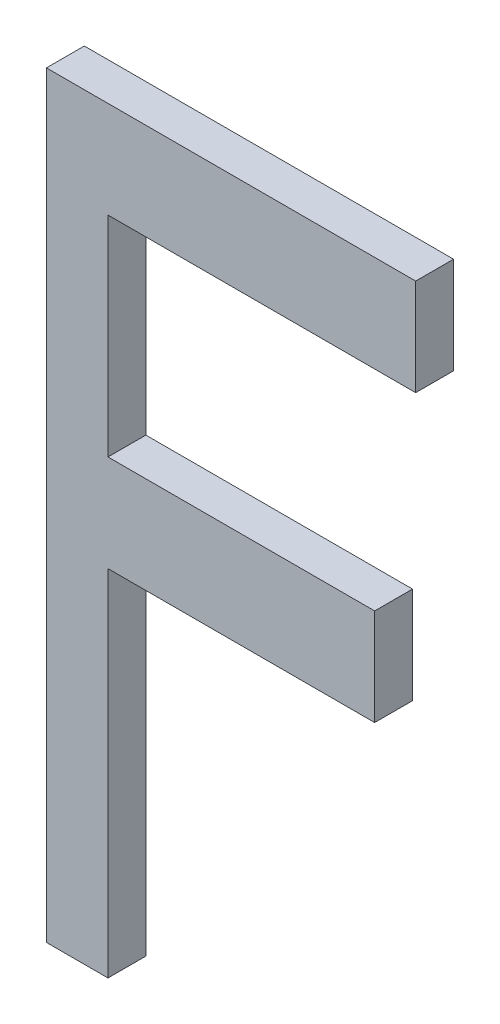
ISO-10303-21;
HEADER;
FILE_DESCRIPTION(('STEP AP214'),'2;1');
FILE_NAME('part.step','',(''),(''),'','','');
FILE_SCHEMA(('AUTOMOTIVE_DESIGN { 1 0 10303 214 1 1 1 1 }'));
ENDSEC;
DATA;
#1=APPLICATION_CONTEXT('core data for automotive mechanical design processes');
#2=APPLICATION_PROTOCOL_DEFINITION('international standard','automotive_design',2000,#1);
#3=PRODUCT_CONTEXT('',#1,'mechanical');
#4=PRODUCT('Part','Part','',(#3));
#5=PRODUCT_RELATED_PRODUCT_CATEGORY('part','',(#4));
#6=PRODUCT_DEFINITION_FORMATION('','',#4);
#7=PRODUCT_DEFINITION_CONTEXT('part definition',#1,'design');
#8=PRODUCT_DEFINITION('design','',#6,#7);
#9=PRODUCT_DEFINITION_SHAPE('','',#8);
#10=(LENGTH_UNIT() NAMED_UNIT(*) SI_UNIT(.MILLI.,.METRE.));
#11=(NAMED_UNIT(*) PLANE_ANGLE_UNIT() SI_UNIT($,.RADIAN.));
#12=(NAMED_UNIT(*) SI_UNIT($,.STERADIAN.) SOLID_ANGLE_UNIT());
#13=UNCERTAINTY_MEASURE_WITH_UNIT(LENGTH_MEASURE(1.E-05),#10,'distance_accuracy_value','');
#14=(GEOMETRIC_REPRESENTATION_CONTEXT(3) GLOBAL_UNCERTAINTY_ASSIGNED_CONTEXT((#13)) GLOBAL_UNIT_ASSIGNED_CONTEXT((#10,
#11,#12)) REPRESENTATION_CONTEXT('',''));
#15=CARTESIAN_POINT('',(0.,0.,0.));
#16=DIRECTION('',(0.,0.,1.));
#17=DIRECTION('',(1.,0.,0.));
#18=AXIS2_PLACEMENT_3D('',#15,#16,#17);
#19=CARTESIAN_POINT('',(128.914831113507,28.2906710184783,5.9));
#20=DIRECTION('',(0.,0.,1.));
#21=DIRECTION('',(1.,0.,0.));
#22=AXIS2_PLACEMENT_3D('',#19,#20,#21);
#23=PLANE('',#22);
#24=DIRECTION('',(1.,0.,0.));
#25=VECTOR('',#24,1.);
#26=CARTESIAN_POINT('',(128.914831113507,30.2906710184783,5.9));
#27=LINE('',#26,#25);
#28=CARTESIAN_POINT('',(129.889831113507,30.2906710184783,5.9));
#29=VERTEX_POINT('',#28);
#30=CARTESIAN_POINT('',(128.914831113507,30.2906710184783,5.9));
#31=VERTEX_POINT('',#30);
#32=EDGE_CURVE('E126',#29,#31,#27,.F.);
#33=ORIENTED_EDGE('',*,*,#32,.F.);
#34=DIRECTION('',(0.,1.,0.));
#35=VECTOR('',#34,1.);
#36=CARTESIAN_POINT('',(129.889831113507,28.2906710184783,5.9));
#37=LINE('',#36,#35);
#38=CARTESIAN_POINT('',(129.889831113507,30.0353518999783,5.9));
#39=VERTEX_POINT('',#38);
#40=EDGE_CURVE('E124',#39,#29,#37,.T.);
#41=ORIENTED_EDGE('',*,*,#40,.F.);
#42=DIRECTION('',(1.,0.,0.));
#43=VECTOR('',#42,1.);
#44=CARTESIAN_POINT('',(128.914831113507,30.0353518999783,5.9));
#45=LINE('',#44,#43);
#46=CARTESIAN_POINT('',(129.077331113507,30.0353518999783,5.9));
#47=VERTEX_POINT('',#46);
#48=EDGE_CURVE('E122',#47,#39,#45,.T.);
#49=ORIENTED_EDGE('',*,*,#48,.F.);
#50=DIRECTION('',(0.,1.,0.));
#51=VECTOR('',#50,1.);
#52=CARTESIAN_POINT('',(129.077331113508,28.2906710184783,5.9));
#53=LINE('',#52,#51);
#54=CARTESIAN_POINT('',(129.077331113508,29.4821603573583,5.9));
#55=VERTEX_POINT('',#54);
#56=EDGE_CURVE('E120',#55,#47,#53,.T.);
#57=ORIENTED_EDGE('',*,*,#56,.F.);
#58=DIRECTION('',(1.,0.,0.));
#59=VECTOR('',#58,1.);
#60=CARTESIAN_POINT('',(128.914831113507,29.4821603573583,5.9));
#61=LINE('',#60,#59);
#62=CARTESIAN_POINT('',(129.781497806007,29.4821603573583,5.9));
#63=VERTEX_POINT('',#62);
#64=EDGE_CURVE('E118',#63,#55,#61,.F.);
#65=ORIENTED_EDGE('',*,*,#64,.F.);
#66=DIRECTION('',(0.,1.,0.));
#67=VECTOR('',#66,1.);
#68=CARTESIAN_POINT('',(129.781497806007,28.2906710184783,5.9));
#69=LINE('',#68,#67);
#70=CARTESIAN_POINT('',(129.781497806007,29.2268412388583,5.9));
#71=VERTEX_POINT('',#70);
#72=EDGE_CURVE('E114',#71,#63,#69,.T.);
#73=ORIENTED_EDGE('',*,*,#72,.F.);
#74=DIRECTION('',(1.,0.,0.));
#75=VECTOR('',#74,1.);
#76=CARTESIAN_POINT('',(128.914831113507,29.2268412388583,5.9));
#77=LINE('',#76,#75);
#78=CARTESIAN_POINT('',(129.077331113507,29.2268412388583,5.9));
#79=VERTEX_POINT('',#78);
#80=EDGE_CURVE('E113',#79,#71,#77,.T.);
#81=ORIENTED_EDGE('',*,*,#80,.F.);
#82=DIRECTION('',(0.,1.,0.));
#83=VECTOR('',#82,1.);
#84=CARTESIAN_POINT('',(129.077331113508,28.2906710184783,5.9));
#85=LINE('',#84,#83);
#86=CARTESIAN_POINT('',(129.077331113508,28.2906710184783,5.9));
#87=VERTEX_POINT('',#86);
#88=EDGE_CURVE('E91',#87,#79,#85,.T.);
#89=ORIENTED_EDGE('',*,*,#88,.F.);
#90=DIRECTION('',(1.,0.,0.));
#91=VECTOR('',#90,1.);
#92=CARTESIAN_POINT('',(128.914831113507,28.2906710184783,5.9));
#93=LINE('',#92,#91);
#94=CARTESIAN_POINT('',(128.914831113507,28.2906710184783,5.9));
#95=VERTEX_POINT('',#94);
#96=EDGE_CURVE('E20',#95,#87,#93,.T.);
#97=ORIENTED_EDGE('',*,*,#96,.F.);
#98=DIRECTION('',(0.,1.,0.));
#99=VECTOR('',#98,1.);
#100=CARTESIAN_POINT('',(128.914831113507,30.2906710184783,5.9));
#101=LINE('',#100,#99);
#102=EDGE_CURVE('E128',#95,#31,#101,.T.);
#103=ORIENTED_EDGE('',*,*,#102,.T.);
#104=EDGE_LOOP('',(#33,#41,#49,#57,#65,#73,#81,#89,#97,#103));
#105=FACE_BOUND('',#104,.T.);
#106=ADVANCED_FACE('F17',(#105),#23,.F.);
#107=CARTESIAN_POINT('',(128.914831113507,30.2906710184783,6.));
#108=DIRECTION('',(1.,0.,0.));
#109=DIRECTION('',(0.,0.,-1.));
#110=AXIS2_PLACEMENT_3D('',#107,#108,#109);
#111=PLANE('',#110);
#112=DIRECTION('',(0.,0.,1.));
#113=VECTOR('',#112,1.);
#114=CARTESIAN_POINT('',(128.914831113507,28.2906710184783,6.));
#115=LINE('',#114,#113);
#116=CARTESIAN_POINT('',(128.914831113507,28.2906710184783,6.));
#117=VERTEX_POINT('',#116);
#118=EDGE_CURVE('E100',#95,#117,#115,.T.);
#119=ORIENTED_EDGE('',*,*,#118,.T.);
#120=DIRECTION('',(0.,1.,0.));
#121=VECTOR('',#120,1.);
#122=CARTESIAN_POINT('',(128.914831113507,28.2906710184783,6.));
#123=LINE('',#122,#121);
#124=CARTESIAN_POINT('',(128.914831113507,30.2906710184783,6.));
#125=VERTEX_POINT('',#124);
#126=EDGE_CURVE('E146',#125,#117,#123,.F.);
#127=ORIENTED_EDGE('',*,*,#126,.F.);
#128=DIRECTION('',(0.,0.,-1.));
#129=VECTOR('',#128,1.);
#130=CARTESIAN_POINT('',(128.914831113507,30.2906710184783,6.));
#131=LINE('',#130,#129);
#132=EDGE_CURVE('E143',#125,#31,#131,.T.);
#133=ORIENTED_EDGE('',*,*,#132,.T.);
#134=ORIENTED_EDGE('',*,*,#102,.F.);
#135=EDGE_LOOP('',(#119,#127,#133,#134));
#136=FACE_BOUND('',#135,.T.);
#137=ADVANCED_FACE('F181',(#136),#111,.F.);
#138=CARTESIAN_POINT('',(128.914831113507,28.2906710184783,6.));
#139=DIRECTION('',(0.,1.,0.));
#140=DIRECTION('',(0.,0.,1.));
#141=AXIS2_PLACEMENT_3D('',#138,#139,#140);
#142=PLANE('',#141);
#143=DIRECTION('',(0.,0.,1.));
#144=VECTOR('',#143,1.);
#145=CARTESIAN_POINT('',(129.077331113507,28.2906710184783,6.));
#146=LINE('',#145,#144);
#147=CARTESIAN_POINT('',(129.077331113508,28.2906710184783,6.));
#148=VERTEX_POINT('',#147);
#149=EDGE_CURVE('E98',#87,#148,#146,.T.);
#150=ORIENTED_EDGE('',*,*,#149,.T.);
#151=DIRECTION('',(1.,0.,0.));
#152=VECTOR('',#151,1.);
#153=CARTESIAN_POINT('',(128.914831113507,28.2906710184783,6.));
#154=LINE('',#153,#152);
#155=EDGE_CURVE('E149',#117,#148,#154,.T.);
#156=ORIENTED_EDGE('',*,*,#155,.F.);
#157=ORIENTED_EDGE('',*,*,#118,.F.);
#158=ORIENTED_EDGE('',*,*,#96,.T.);
#159=EDGE_LOOP('',(#150,#156,#157,#158));
#160=FACE_BOUND('',#159,.T.);
#161=ADVANCED_FACE('F96',(#160),#142,.F.);
#162=CARTESIAN_POINT('',(129.077331113507,28.2906710184783,6.));
#163=DIRECTION('',(-1.,0.,0.));
#164=DIRECTION('',(0.,0.,1.));
#165=AXIS2_PLACEMENT_3D('',#162,#163,#164);
#166=PLANE('',#165);
#167=DIRECTION('',(0.,0.,1.));
#168=VECTOR('',#167,1.);
#169=CARTESIAN_POINT('',(129.077331113507,29.2268412388583,6.));
#170=LINE('',#169,#168);
#171=CARTESIAN_POINT('',(129.077331113507,29.2268412388583,6.));
#172=VERTEX_POINT('',#171);
#173=EDGE_CURVE('E108',#79,#172,#170,.T.);
#174=ORIENTED_EDGE('',*,*,#173,.T.);
#175=DIRECTION('',(0.,1.,0.));
#176=VECTOR('',#175,1.);
#177=CARTESIAN_POINT('',(129.077331113508,28.2906710184783,6.));
#178=LINE('',#177,#176);
#179=EDGE_CURVE('E106',#148,#172,#178,.T.);
#180=ORIENTED_EDGE('',*,*,#179,.F.);
#181=ORIENTED_EDGE('',*,*,#149,.F.);
#182=ORIENTED_EDGE('',*,*,#88,.T.);
#183=EDGE_LOOP('',(#174,#180,#181,#182));
#184=FACE_BOUND('',#183,.T.);
#185=ADVANCED_FACE('F104',(#184),#166,.F.);
#186=CARTESIAN_POINT('',(129.077331113507,29.2268412388583,6.));
#187=DIRECTION('',(0.,1.,0.));
#188=DIRECTION('',(0.,0.,1.));
#189=AXIS2_PLACEMENT_3D('',#186,#187,#188);
#190=PLANE('',#189);
#191=DIRECTION('',(0.,0.,1.));
#192=VECTOR('',#191,1.);
#193=CARTESIAN_POINT('',(129.781497806007,29.2268412388583,6.));
#194=LINE('',#193,#192);
#195=CARTESIAN_POINT('',(129.781497806007,29.2268412388583,6.));
#196=VERTEX_POINT('',#195);
#197=EDGE_CURVE('E132',#71,#196,#194,.T.);
#198=ORIENTED_EDGE('',*,*,#197,.T.);
#199=DIRECTION('',(1.,0.,0.));
#200=VECTOR('',#199,1.);
#201=CARTESIAN_POINT('',(128.914831113507,29.2268412388583,6.));
#202=LINE('',#201,#200);
#203=EDGE_CURVE('E152',#172,#196,#202,.T.);
#204=ORIENTED_EDGE('',*,*,#203,.F.);
#205=ORIENTED_EDGE('',*,*,#173,.F.);
#206=ORIENTED_EDGE('',*,*,#80,.T.);
#207=EDGE_LOOP('',(#198,#204,#205,#206));
#208=FACE_BOUND('',#207,.T.);
#209=ADVANCED_FACE('F185',(#208),#190,.F.);
#210=CARTESIAN_POINT('',(129.781497806007,29.2268412388583,6.));
#211=DIRECTION('',(-1.,0.,0.));
#212=DIRECTION('',(0.,0.,1.));
#213=AXIS2_PLACEMENT_3D('',#210,#211,#212);
#214=PLANE('',#213);
#215=DIRECTION('',(0.,0.,-1.));
#216=VECTOR('',#215,1.);
#217=CARTESIAN_POINT('',(129.781497806007,29.4821603573583,6.));
#218=LINE('',#217,#216);
#219=CARTESIAN_POINT('',(129.781497806007,29.4821603573583,6.));
#220=VERTEX_POINT('',#219);
#221=EDGE_CURVE('E134',#63,#220,#218,.F.);
#222=ORIENTED_EDGE('',*,*,#221,.T.);
#223=DIRECTION('',(0.,1.,0.));
#224=VECTOR('',#223,1.);
#225=CARTESIAN_POINT('',(129.781497806007,28.2906710184783,6.));
#226=LINE('',#225,#224);
#227=EDGE_CURVE('E155',#196,#220,#226,.T.);
#228=ORIENTED_EDGE('',*,*,#227,.F.);
#229=ORIENTED_EDGE('',*,*,#197,.F.);
#230=ORIENTED_EDGE('',*,*,#72,.T.);
#231=EDGE_LOOP('',(#222,#228,#229,#230));
#232=FACE_BOUND('',#231,.T.);
#233=ADVANCED_FACE('F188',(#232),#214,.F.);
#234=CARTESIAN_POINT('',(129.781497806007,29.4821603573583,6.));
#235=DIRECTION('',(0.,-1.,0.));
#236=DIRECTION('',(0.,0.,-1.));
#237=AXIS2_PLACEMENT_3D('',#234,#235,#236);
#238=PLANE('',#237);
#239=DIRECTION('',(0.,0.,1.));
#240=VECTOR('',#239,1.);
#241=CARTESIAN_POINT('',(129.077331113507,29.4821603573583,6.));
#242=LINE('',#241,#240);
#243=CARTESIAN_POINT('',(129.077331113508,29.4821603573583,6.));
#244=VERTEX_POINT('',#243);
#245=EDGE_CURVE('E136',#55,#244,#242,.T.);
#246=ORIENTED_EDGE('',*,*,#245,.T.);
#247=DIRECTION('',(1.,0.,0.));
#248=VECTOR('',#247,1.);
#249=CARTESIAN_POINT('',(128.914831113507,29.4821603573583,6.));
#250=LINE('',#249,#248);
#251=EDGE_CURVE('E158',#220,#244,#250,.F.);
#252=ORIENTED_EDGE('',*,*,#251,.F.);
#253=ORIENTED_EDGE('',*,*,#221,.F.);
#254=ORIENTED_EDGE('',*,*,#64,.T.);
#255=EDGE_LOOP('',(#246,#252,#253,#254));
#256=FACE_BOUND('',#255,.T.);
#257=ADVANCED_FACE('F193',(#256),#238,.F.);
#258=CARTESIAN_POINT('',(129.077331113507,29.4821603573583,6.));
#259=DIRECTION('',(-1.,0.,0.));
#260=DIRECTION('',(0.,0.,1.));
#261=AXIS2_PLACEMENT_3D('',#258,#259,#260);
#262=PLANE('',#261);
#263=DIRECTION('',(0.,0.,1.));
#264=VECTOR('',#263,1.);
#265=CARTESIAN_POINT('',(129.077331113507,30.0353518999783,6.));
#266=LINE('',#265,#264);
#267=CARTESIAN_POINT('',(129.077331113507,30.0353518999783,6.));
#268=VERTEX_POINT('',#267);
#269=EDGE_CURVE('E138',#47,#268,#266,.T.);
#270=ORIENTED_EDGE('',*,*,#269,.T.);
#271=DIRECTION('',(0.,1.,0.));
#272=VECTOR('',#271,1.);
#273=CARTESIAN_POINT('',(129.077331113508,28.2906710184783,6.));
#274=LINE('',#273,#272);
#275=EDGE_CURVE('E161',#244,#268,#274,.T.);
#276=ORIENTED_EDGE('',*,*,#275,.F.);
#277=ORIENTED_EDGE('',*,*,#245,.F.);
#278=ORIENTED_EDGE('',*,*,#56,.T.);
#279=EDGE_LOOP('',(#270,#276,#277,#278));
#280=FACE_BOUND('',#279,.T.);
#281=ADVANCED_FACE('F197',(#280),#262,.F.);
#282=CARTESIAN_POINT('',(129.077331113507,30.0353518999783,6.));
#283=DIRECTION('',(0.,1.,0.));
#284=DIRECTION('',(0.,0.,1.));
#285=AXIS2_PLACEMENT_3D('',#282,#283,#284);
#286=PLANE('',#285);
#287=DIRECTION('',(0.,0.,1.));
#288=VECTOR('',#287,1.);
#289=CARTESIAN_POINT('',(129.889831113507,30.0353518999783,6.));
#290=LINE('',#289,#288);
#291=CARTESIAN_POINT('',(129.889831113507,30.0353518999783,6.));
#292=VERTEX_POINT('',#291);
#293=EDGE_CURVE('E140',#39,#292,#290,.T.);
#294=ORIENTED_EDGE('',*,*,#293,.T.);
#295=DIRECTION('',(1.,0.,0.));
#296=VECTOR('',#295,1.);
#297=CARTESIAN_POINT('',(128.914831113507,30.0353518999783,6.));
#298=LINE('',#297,#296);
#299=EDGE_CURVE('E164',#268,#292,#298,.T.);
#300=ORIENTED_EDGE('',*,*,#299,.F.);
#301=ORIENTED_EDGE('',*,*,#269,.F.);
#302=ORIENTED_EDGE('',*,*,#48,.T.);
#303=EDGE_LOOP('',(#294,#300,#301,#302));
#304=FACE_BOUND('',#303,.T.);
#305=ADVANCED_FACE('F199',(#304),#286,.F.);
#306=CARTESIAN_POINT('',(129.889831113507,30.0353518999783,6.));
#307=DIRECTION('',(-1.,0.,0.));
#308=DIRECTION('',(0.,0.,1.));
#309=AXIS2_PLACEMENT_3D('',#306,#307,#308);
#310=PLANE('',#309);
#311=DIRECTION('',(0.,0.,-1.));
#312=VECTOR('',#311,1.);
#313=CARTESIAN_POINT('',(129.889831113507,30.2906710184783,6.));
#314=LINE('',#313,#312);
#315=CARTESIAN_POINT('',(129.889831113507,30.2906710184783,6.));
#316=VERTEX_POINT('',#315);
#317=EDGE_CURVE('E35',#29,#316,#314,.F.);
#318=ORIENTED_EDGE('',*,*,#317,.T.);
#319=DIRECTION('',(0.,1.,0.));
#320=VECTOR('',#319,1.);
#321=CARTESIAN_POINT('',(129.889831113507,28.2906710184783,6.));
#322=LINE('',#321,#320);
#323=EDGE_CURVE('E26',#292,#316,#322,.T.);
#324=ORIENTED_EDGE('',*,*,#323,.F.);
#325=ORIENTED_EDGE('',*,*,#293,.F.);
#326=ORIENTED_EDGE('',*,*,#40,.T.);
#327=EDGE_LOOP('',(#318,#324,#325,#326));
#328=FACE_BOUND('',#327,.T.);
#329=ADVANCED_FACE('F172',(#328),#310,.F.);
#330=CARTESIAN_POINT('',(129.889831113507,30.2906710184783,6.));
#331=DIRECTION('',(0.,-1.,0.));
#332=DIRECTION('',(0.,0.,-1.));
#333=AXIS2_PLACEMENT_3D('',#330,#331,#332);
#334=PLANE('',#333);
#335=ORIENTED_EDGE('',*,*,#132,.F.);
#336=DIRECTION('',(1.,0.,0.));
#337=VECTOR('',#336,1.);
#338=CARTESIAN_POINT('',(128.914831113507,30.2906710184783,6.));
#339=LINE('',#338,#337);
#340=EDGE_CURVE('E11',#316,#125,#339,.F.);
#341=ORIENTED_EDGE('',*,*,#340,.F.);
#342=ORIENTED_EDGE('',*,*,#317,.F.);
#343=ORIENTED_EDGE('',*,*,#32,.T.);
#344=EDGE_LOOP('',(#335,#341,#342,#343));
#345=FACE_BOUND('',#344,.T.);
#346=ADVANCED_FACE('F179',(#345),#334,.F.);
#347=CARTESIAN_POINT('',(128.914831113507,28.2906710184783,6.));
#348=DIRECTION('',(0.,0.,1.));
#349=DIRECTION('',(1.,0.,0.));
#350=AXIS2_PLACEMENT_3D('',#347,#348,#349);
#351=PLANE('',#350);
#352=ORIENTED_EDGE('',*,*,#323,.T.);
#353=ORIENTED_EDGE('',*,*,#340,.T.);
#354=ORIENTED_EDGE('',*,*,#126,.T.);
#355=ORIENTED_EDGE('',*,*,#155,.T.);
#356=ORIENTED_EDGE('',*,*,#179,.T.);
#357=ORIENTED_EDGE('',*,*,#203,.T.);
#358=ORIENTED_EDGE('',*,*,#227,.T.);
#359=ORIENTED_EDGE('',*,*,#251,.T.);
#360=ORIENTED_EDGE('',*,*,#275,.T.);
#361=ORIENTED_EDGE('',*,*,#299,.T.);
#362=EDGE_LOOP('',(#352,#353,#354,#355,#356,#357,#358,#359,#360,#361));
#363=FACE_BOUND('',#362,.T.);
#364=ADVANCED_FACE('F169',(#363),#351,.T.);
#365=CLOSED_SHELL('',(#106,#137,#161,#185,#209,#233,#257,#281,#305,#329,#346,#364));
#366=MANIFOLD_SOLID_BREP('B1',#365);
#367=ADVANCED_BREP_SHAPE_REPRESENTATION('',(#18,#366),#14);
#368=SHAPE_DEFINITION_REPRESENTATION(#9,#367);
ENDSEC;
END-ISO-10303-21;
